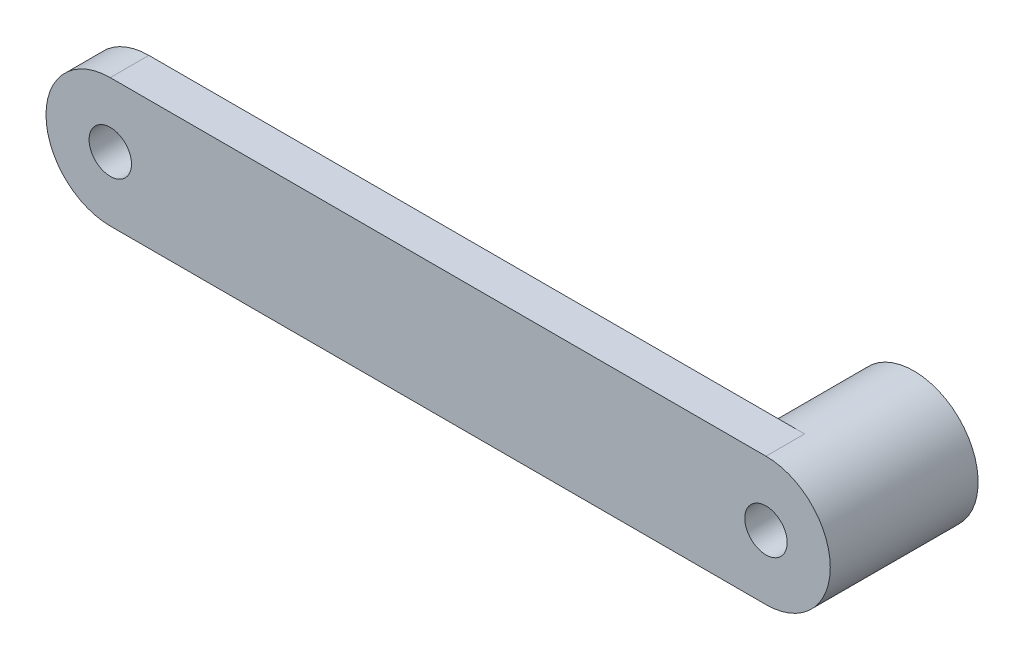
ISO-10303-21;
HEADER;
FILE_DESCRIPTION(('STEP AP214'),'2;1');
FILE_NAME('part.step','',(''),(''),'','','');
FILE_SCHEMA(('AUTOMOTIVE_DESIGN { 1 0 10303 214 1 1 1 1 }'));
ENDSEC;
DATA;
#1=APPLICATION_CONTEXT('core data for automotive mechanical design processes');
#2=APPLICATION_PROTOCOL_DEFINITION('international standard','automotive_design',2000,#1);
#3=PRODUCT_CONTEXT('',#1,'mechanical');
#4=PRODUCT('Part','Part','',(#3));
#5=PRODUCT_RELATED_PRODUCT_CATEGORY('part','',(#4));
#6=PRODUCT_DEFINITION_FORMATION('','',#4);
#7=PRODUCT_DEFINITION_CONTEXT('part definition',#1,'design');
#8=PRODUCT_DEFINITION('design','',#6,#7);
#9=PRODUCT_DEFINITION_SHAPE('','',#8);
#10=(LENGTH_UNIT() NAMED_UNIT(*) SI_UNIT(.MILLI.,.METRE.));
#11=(NAMED_UNIT(*) PLANE_ANGLE_UNIT() SI_UNIT($,.RADIAN.));
#12=(NAMED_UNIT(*) SI_UNIT($,.STERADIAN.) SOLID_ANGLE_UNIT());
#13=UNCERTAINTY_MEASURE_WITH_UNIT(LENGTH_MEASURE(1.E-05),#10,'distance_accuracy_value','');
#14=(GEOMETRIC_REPRESENTATION_CONTEXT(3) GLOBAL_UNCERTAINTY_ASSIGNED_CONTEXT((#13)) GLOBAL_UNIT_ASSIGNED_CONTEXT((#10,
#11,#12)) REPRESENTATION_CONTEXT('',''));
#15=CARTESIAN_POINT('',(0.,0.,0.));
#16=DIRECTION('',(0.,0.,1.));
#17=DIRECTION('',(1.,0.,0.));
#18=AXIS2_PLACEMENT_3D('',#15,#16,#17);
#19=CARTESIAN_POINT('',(0.,0.,0.));
#20=DIRECTION('',(0.,0.,1.));
#21=DIRECTION('',(1.,0.,0.));
#22=AXIS2_PLACEMENT_3D('',#19,#20,#21);
#23=PLANE('',#22);
#24=CARTESIAN_POINT('',(0.,0.,0.));
#25=DIRECTION('',(0.,0.,1.));
#26=DIRECTION('',(1.,0.,0.));
#27=AXIS2_PLACEMENT_3D('',#24,#25,#26);
#28=CIRCLE('',#27,1.65);
#29=CARTESIAN_POINT('',(1.65,0.,0.));
#30=VERTEX_POINT('',#29);
#31=EDGE_CURVE('E116',#30,#30,#28,.T.);
#32=ORIENTED_EDGE('',*,*,#31,.T.);
#33=EDGE_LOOP('',(#32));
#34=FACE_BOUND('',#33,.T.);
#35=CARTESIAN_POINT('',(51.,0.,0.));
#36=DIRECTION('',(0.,0.,-1.));
#37=DIRECTION('',(-1.,0.,0.));
#38=AXIS2_PLACEMENT_3D('',#35,#36,#37);
#39=CIRCLE('',#38,5.);
#40=CARTESIAN_POINT('',(51.,-5.,0.));
#41=VERTEX_POINT('',#40);
#42=CARTESIAN_POINT('',(51.,5.,0.));
#43=VERTEX_POINT('',#42);
#44=EDGE_CURVE('E11',#41,#43,#39,.T.);
#45=ORIENTED_EDGE('',*,*,#44,.F.);
#46=DIRECTION('',(1.,0.,0.));
#47=VECTOR('',#46,1.);
#48=CARTESIAN_POINT('',(0.,-5.,0.));
#49=LINE('',#48,#47);
#50=CARTESIAN_POINT('',(0.,-5.,0.));
#51=VERTEX_POINT('',#50);
#52=EDGE_CURVE('E84',#51,#41,#49,.T.);
#53=ORIENTED_EDGE('',*,*,#52,.F.);
#54=CARTESIAN_POINT('',(0.,0.,0.));
#55=DIRECTION('',(0.,0.,1.));
#56=DIRECTION('',(1.,0.,0.));
#57=AXIS2_PLACEMENT_3D('',#54,#55,#56);
#58=CIRCLE('',#57,5.);
#59=CARTESIAN_POINT('',(0.,5.,0.));
#60=VERTEX_POINT('',#59);
#61=EDGE_CURVE('E82',#60,#51,#58,.T.);
#62=ORIENTED_EDGE('',*,*,#61,.F.);
#63=DIRECTION('',(-1.,0.,0.));
#64=VECTOR('',#63,1.);
#65=CARTESIAN_POINT('',(0.,5.,0.));
#66=LINE('',#65,#64);
#67=EDGE_CURVE('E70',#43,#60,#66,.T.);
#68=ORIENTED_EDGE('',*,*,#67,.F.);
#69=EDGE_LOOP('',(#45,#53,#62,#68));
#70=FACE_BOUND('',#69,.T.);
#71=ADVANCED_FACE('F33',(#34,#70),#23,.F.);
#72=CARTESIAN_POINT('',(0.,0.,3.));
#73=DIRECTION('',(0.,0.,1.));
#74=DIRECTION('',(1.,0.,0.));
#75=AXIS2_PLACEMENT_3D('',#72,#73,#74);
#76=PLANE('',#75);
#77=CARTESIAN_POINT('',(0.,0.,3.));
#78=DIRECTION('',(0.,0.,1.));
#79=DIRECTION('',(1.,0.,0.));
#80=AXIS2_PLACEMENT_3D('',#77,#78,#79);
#81=CIRCLE('',#80,1.65);
#82=CARTESIAN_POINT('',(1.65,0.,3.));
#83=VERTEX_POINT('',#82);
#84=EDGE_CURVE('E111',#83,#83,#81,.T.);
#85=ORIENTED_EDGE('',*,*,#84,.F.);
#86=EDGE_LOOP('',(#85));
#87=FACE_BOUND('',#86,.T.);
#88=CARTESIAN_POINT('',(0.,0.,3.));
#89=DIRECTION('',(0.,0.,1.));
#90=DIRECTION('',(1.,0.,0.));
#91=AXIS2_PLACEMENT_3D('',#88,#89,#90);
#92=CIRCLE('',#91,5.);
#93=CARTESIAN_POINT('',(0.,5.,3.));
#94=VERTEX_POINT('',#93);
#95=CARTESIAN_POINT('',(0.,-5.,3.));
#96=VERTEX_POINT('',#95);
#97=EDGE_CURVE('E83',#94,#96,#92,.T.);
#98=ORIENTED_EDGE('',*,*,#97,.T.);
#99=DIRECTION('',(1.,0.,0.));
#100=VECTOR('',#99,1.);
#101=CARTESIAN_POINT('',(0.,-5.,3.));
#102=LINE('',#101,#100);
#103=CARTESIAN_POINT('',(51.,-5.,3.));
#104=VERTEX_POINT('',#103);
#105=EDGE_CURVE('E78',#96,#104,#102,.T.);
#106=ORIENTED_EDGE('',*,*,#105,.T.);
#107=CARTESIAN_POINT('',(51.,0.,3.));
#108=DIRECTION('',(0.,0.,1.));
#109=DIRECTION('',(1.,0.,0.));
#110=AXIS2_PLACEMENT_3D('',#107,#108,#109);
#111=CIRCLE('',#110,5.);
#112=CARTESIAN_POINT('',(51.,5.,3.));
#113=VERTEX_POINT('',#112);
#114=EDGE_CURVE('E97',#104,#113,#111,.T.);
#115=ORIENTED_EDGE('',*,*,#114,.T.);
#116=DIRECTION('',(-1.,0.,0.));
#117=VECTOR('',#116,1.);
#118=CARTESIAN_POINT('',(0.,5.,3.));
#119=LINE('',#118,#117);
#120=EDGE_CURVE('E52',#113,#94,#119,.T.);
#121=ORIENTED_EDGE('',*,*,#120,.T.);
#122=EDGE_LOOP('',(#98,#106,#115,#121));
#123=FACE_BOUND('',#122,.T.);
#124=CARTESIAN_POINT('',(51.,0.,3.));
#125=DIRECTION('',(0.,0.,1.));
#126=DIRECTION('',(1.,0.,0.));
#127=AXIS2_PLACEMENT_3D('',#124,#125,#126);
#128=CIRCLE('',#127,1.65);
#129=CARTESIAN_POINT('',(52.65,0.,3.));
#130=VERTEX_POINT('',#129);
#131=EDGE_CURVE('E119',#130,#130,#128,.T.);
#132=ORIENTED_EDGE('',*,*,#131,.F.);
#133=EDGE_LOOP('',(#132));
#134=FACE_BOUND('',#133,.T.);
#135=ADVANCED_FACE('F144',(#87,#123,#134),#76,.T.);
#136=CARTESIAN_POINT('',(0.,0.,3.));
#137=DIRECTION('',(0.,0.,-1.));
#138=DIRECTION('',(-1.,0.,0.));
#139=AXIS2_PLACEMENT_3D('',#136,#137,#138);
#140=CYLINDRICAL_SURFACE('',#139,5.);
#141=ORIENTED_EDGE('',*,*,#61,.T.);
#142=DIRECTION('',(0.,0.,-1.));
#143=VECTOR('',#142,1.);
#144=CARTESIAN_POINT('',(0.,-5.,3.));
#145=LINE('',#144,#143);
#146=EDGE_CURVE('E43',#96,#51,#145,.T.);
#147=ORIENTED_EDGE('',*,*,#146,.F.);
#148=ORIENTED_EDGE('',*,*,#97,.F.);
#149=DIRECTION('',(0.,0.,-1.));
#150=VECTOR('',#149,1.);
#151=CARTESIAN_POINT('',(0.,5.,3.));
#152=LINE('',#151,#150);
#153=EDGE_CURVE('E92',#94,#60,#152,.T.);
#154=ORIENTED_EDGE('',*,*,#153,.T.);
#155=EDGE_LOOP('',(#141,#147,#148,#154));
#156=FACE_BOUND('',#155,.T.);
#157=ADVANCED_FACE('F35',(#156),#140,.T.);
#158=CARTESIAN_POINT('',(0.,-5.,3.));
#159=DIRECTION('',(0.,1.,0.));
#160=DIRECTION('',(0.,0.,1.));
#161=AXIS2_PLACEMENT_3D('',#158,#159,#160);
#162=PLANE('',#161);
#163=ORIENTED_EDGE('',*,*,#52,.T.);
#164=DIRECTION('',(0.,0.,-1.));
#165=VECTOR('',#164,1.);
#166=CARTESIAN_POINT('',(51.,-5.,3.));
#167=LINE('',#166,#165);
#168=EDGE_CURVE('E91',#104,#41,#167,.T.);
#169=ORIENTED_EDGE('',*,*,#168,.F.);
#170=ORIENTED_EDGE('',*,*,#105,.F.);
#171=ORIENTED_EDGE('',*,*,#146,.T.);
#172=EDGE_LOOP('',(#163,#169,#170,#171));
#173=FACE_BOUND('',#172,.T.);
#174=ADVANCED_FACE('F157',(#173),#162,.F.);
#175=CARTESIAN_POINT('',(51.,0.,3.));
#176=DIRECTION('',(0.,0.,-1.));
#177=DIRECTION('',(-1.,0.,0.));
#178=AXIS2_PLACEMENT_3D('',#175,#176,#177);
#179=CYLINDRICAL_SURFACE('',#178,5.);
#180=ORIENTED_EDGE('',*,*,#168,.T.);
#181=ORIENTED_EDGE('',*,*,#44,.T.);
#182=DIRECTION('',(0.,0.,-1.));
#183=VECTOR('',#182,1.);
#184=CARTESIAN_POINT('',(51.,5.,3.));
#185=LINE('',#184,#183);
#186=EDGE_CURVE('E87',#113,#43,#185,.T.);
#187=ORIENTED_EDGE('',*,*,#186,.F.);
#188=ORIENTED_EDGE('',*,*,#114,.F.);
#189=EDGE_LOOP('',(#180,#181,#187,#188));
#190=FACE_BOUND('',#189,.T.);
#191=CARTESIAN_POINT('',(51.,0.,-8.5));
#192=DIRECTION('',(0.,0.,-1.));
#193=DIRECTION('',(-1.,0.,0.));
#194=AXIS2_PLACEMENT_3D('',#191,#192,#193);
#195=CIRCLE('',#194,5.);
#196=CARTESIAN_POINT('',(46.,0.,-8.5));
#197=VERTEX_POINT('',#196);
#198=EDGE_CURVE('E124',#197,#197,#195,.T.);
#199=ORIENTED_EDGE('',*,*,#198,.F.);
#200=EDGE_LOOP('',(#199));
#201=FACE_BOUND('',#200,.T.);
#202=ADVANCED_FACE('F95',(#190,#201),#179,.T.);
#203=CARTESIAN_POINT('',(0.,5.,3.));
#204=DIRECTION('',(0.,-1.,0.));
#205=DIRECTION('',(0.,0.,-1.));
#206=AXIS2_PLACEMENT_3D('',#203,#204,#205);
#207=PLANE('',#206);
#208=ORIENTED_EDGE('',*,*,#67,.T.);
#209=ORIENTED_EDGE('',*,*,#153,.F.);
#210=ORIENTED_EDGE('',*,*,#120,.F.);
#211=ORIENTED_EDGE('',*,*,#186,.T.);
#212=EDGE_LOOP('',(#208,#209,#210,#211));
#213=FACE_BOUND('',#212,.T.);
#214=ADVANCED_FACE('F88',(#213),#207,.F.);
#215=CARTESIAN_POINT('',(0.,0.,3.));
#216=DIRECTION('',(0.,0.,-1.));
#217=DIRECTION('',(-1.,0.,0.));
#218=AXIS2_PLACEMENT_3D('',#215,#216,#217);
#219=CYLINDRICAL_SURFACE('',#218,1.65);
#220=ORIENTED_EDGE('',*,*,#84,.T.);
#221=EDGE_LOOP('',(#220));
#222=FACE_BOUND('',#221,.T.);
#223=ORIENTED_EDGE('',*,*,#31,.F.);
#224=EDGE_LOOP('',(#223));
#225=FACE_BOUND('',#224,.T.);
#226=ADVANCED_FACE('F140',(#222,#225),#219,.F.);
#227=CARTESIAN_POINT('',(51.,0.,3.));
#228=DIRECTION('',(0.,0.,-1.));
#229=DIRECTION('',(-1.,0.,0.));
#230=AXIS2_PLACEMENT_3D('',#227,#228,#229);
#231=CYLINDRICAL_SURFACE('',#230,1.65);
#232=ORIENTED_EDGE('',*,*,#131,.T.);
#233=EDGE_LOOP('',(#232));
#234=FACE_BOUND('',#233,.T.);
#235=CARTESIAN_POINT('',(51.,0.,-8.5));
#236=DIRECTION('',(0.,0.,-1.));
#237=DIRECTION('',(-1.,0.,0.));
#238=AXIS2_PLACEMENT_3D('',#235,#236,#237);
#239=CIRCLE('',#238,1.65);
#240=CARTESIAN_POINT('',(49.35,0.,-8.5));
#241=VERTEX_POINT('',#240);
#242=EDGE_CURVE('E127',#241,#241,#239,.T.);
#243=ORIENTED_EDGE('',*,*,#242,.T.);
#244=EDGE_LOOP('',(#243));
#245=FACE_BOUND('',#244,.T.);
#246=ADVANCED_FACE('F131',(#234,#245),#231,.F.);
#247=CARTESIAN_POINT('',(51.,0.,-8.5));
#248=DIRECTION('',(0.,0.,-1.));
#249=DIRECTION('',(-1.,0.,0.));
#250=AXIS2_PLACEMENT_3D('',#247,#248,#249);
#251=PLANE('',#250);
#252=ORIENTED_EDGE('',*,*,#198,.T.);
#253=EDGE_LOOP('',(#252));
#254=FACE_BOUND('',#253,.T.);
#255=ORIENTED_EDGE('',*,*,#242,.F.);
#256=EDGE_LOOP('',(#255));
#257=FACE_BOUND('',#256,.T.);
#258=ADVANCED_FACE('F133',(#254,#257),#251,.T.);
#259=CLOSED_SHELL('',(#71,#135,#157,#174,#202,#214,#226,#246,#258));
#260=MANIFOLD_SOLID_BREP('B2',#259);
#261=ADVANCED_BREP_SHAPE_REPRESENTATION('',(#18,#260),#14);
#262=SHAPE_DEFINITION_REPRESENTATION(#9,#261);
ENDSEC;
END-ISO-10303-21;
